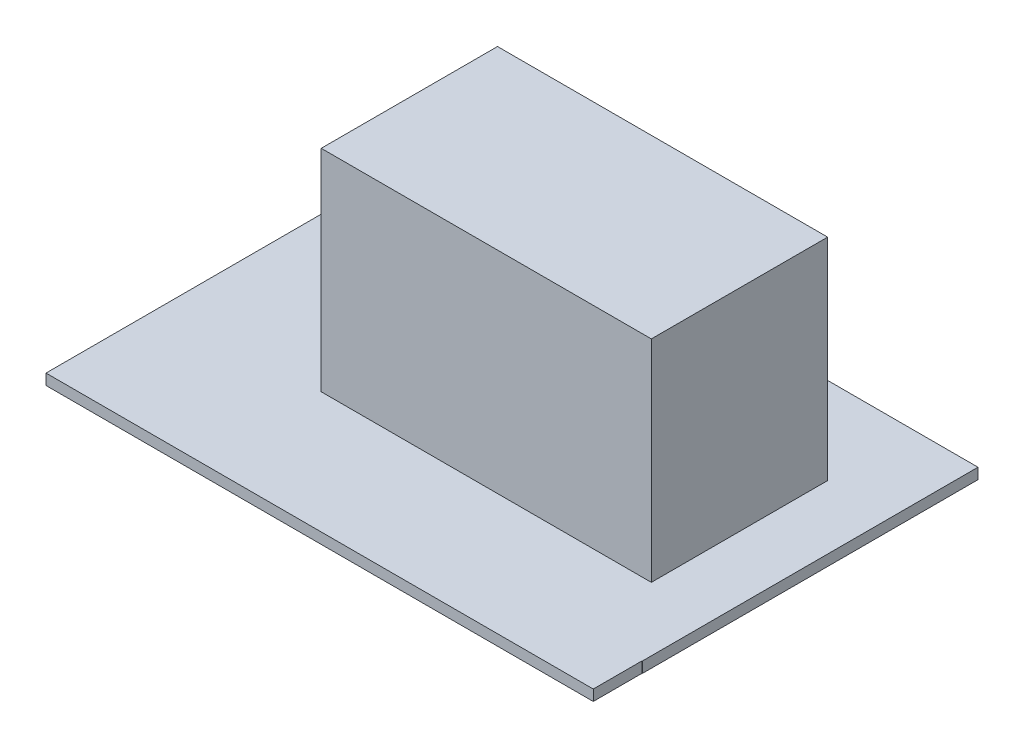
ISO-10303-21;
HEADER;
FILE_DESCRIPTION(('STEP AP214'),'2;1');
FILE_NAME('part.step','',(''),(''),'','','');
FILE_SCHEMA(('AUTOMOTIVE_DESIGN { 1 0 10303 214 1 1 1 1 }'));
ENDSEC;
DATA;
#1=APPLICATION_CONTEXT('core data for automotive mechanical design processes');
#2=APPLICATION_PROTOCOL_DEFINITION('international standard','automotive_design',2000,#1);
#3=PRODUCT_CONTEXT('',#1,'mechanical');
#4=PRODUCT('Part','Part','',(#3));
#5=PRODUCT_RELATED_PRODUCT_CATEGORY('part','',(#4));
#6=PRODUCT_DEFINITION_FORMATION('','',#4);
#7=PRODUCT_DEFINITION_CONTEXT('part definition',#1,'design');
#8=PRODUCT_DEFINITION('design','',#6,#7);
#9=PRODUCT_DEFINITION_SHAPE('','',#8);
#10=(LENGTH_UNIT() NAMED_UNIT(*) SI_UNIT(.MILLI.,.METRE.));
#11=(NAMED_UNIT(*) PLANE_ANGLE_UNIT() SI_UNIT($,.RADIAN.));
#12=(NAMED_UNIT(*) SI_UNIT($,.STERADIAN.) SOLID_ANGLE_UNIT());
#13=UNCERTAINTY_MEASURE_WITH_UNIT(LENGTH_MEASURE(1.E-05),#10,'distance_accuracy_value','');
#14=(GEOMETRIC_REPRESENTATION_CONTEXT(3) GLOBAL_UNCERTAINTY_ASSIGNED_CONTEXT((#13)) GLOBAL_UNIT_ASSIGNED_CONTEXT((#10,
#11,#12)) REPRESENTATION_CONTEXT('',''));
#15=CARTESIAN_POINT('',(0.,0.,0.));
#16=DIRECTION('',(0.,0.,1.));
#17=DIRECTION('',(1.,0.,0.));
#18=AXIS2_PLACEMENT_3D('',#15,#16,#17);
#19=CARTESIAN_POINT('',(0.,1.5875,0.));
#20=DIRECTION('',(0.,1.,0.));
#21=DIRECTION('',(0.,0.,1.));
#22=AXIS2_PLACEMENT_3D('',#19,#20,#21);
#23=PLANE('',#22);
#24=DIRECTION('',(-1.,0.,0.));
#25=VECTOR('',#24,1.);
#26=CARTESIAN_POINT('',(80.4672,1.5875,0.));
#27=LINE('',#26,#25);
#28=CARTESIAN_POINT('',(80.4672,1.5875,0.));
#29=VERTEX_POINT('',#28);
#30=CARTESIAN_POINT('',(0.,1.5875,0.));
#31=VERTEX_POINT('',#30);
#32=EDGE_CURVE('E192',#29,#31,#27,.T.);
#33=ORIENTED_EDGE('',*,*,#32,.T.);
#34=DIRECTION('',(0.,0.,1.));
#35=VECTOR('',#34,1.);
#36=CARTESIAN_POINT('',(0.,1.5875,0.));
#37=LINE('',#36,#35);
#38=CARTESIAN_POINT('',(0.,1.5875,56.4985128166023));
#39=VERTEX_POINT('',#38);
#40=EDGE_CURVE('E185',#31,#39,#37,.T.);
#41=ORIENTED_EDGE('',*,*,#40,.T.);
#42=DIRECTION('',(1.,0.,0.));
#43=VECTOR('',#42,1.);
#44=CARTESIAN_POINT('',(0.,1.5875,56.4985128166023));
#45=LINE('',#44,#43);
#46=CARTESIAN_POINT('',(80.4243209555985,1.5875,56.4985128166023));
#47=VERTEX_POINT('',#46);
#48=EDGE_CURVE('E190',#39,#47,#45,.T.);
#49=ORIENTED_EDGE('',*,*,#48,.T.);
#50=DIRECTION('',(0.,0.,-1.));
#51=VECTOR('',#50,1.);
#52=CARTESIAN_POINT('',(80.4243209555985,1.5875,0.));
#53=LINE('',#52,#51);
#54=CARTESIAN_POINT('',(80.4243209555985,1.5875,49.3268));
#55=VERTEX_POINT('',#54);
#56=EDGE_CURVE('E205',#47,#55,#53,.T.);
#57=ORIENTED_EDGE('',*,*,#56,.T.);
#58=DIRECTION('',(1.,0.,0.));
#59=VECTOR('',#58,1.);
#60=CARTESIAN_POINT('',(31.9532,1.5875,49.3268));
#61=LINE('',#60,#59);
#62=CARTESIAN_POINT('',(80.4672,1.5875,49.3268));
#63=VERTEX_POINT('',#62);
#64=EDGE_CURVE('E49',#55,#63,#61,.T.);
#65=ORIENTED_EDGE('',*,*,#64,.T.);
#66=DIRECTION('',(0.,0.,-1.));
#67=VECTOR('',#66,1.);
#68=CARTESIAN_POINT('',(80.4672,1.5875,49.3268));
#69=LINE('',#68,#67);
#70=EDGE_CURVE('E405',#63,#29,#69,.T.);
#71=ORIENTED_EDGE('',*,*,#70,.T.);
#72=EDGE_LOOP('',(#33,#41,#49,#57,#65,#71));
#73=FACE_BOUND('',#72,.T.);
#74=DIRECTION('',(-1.,0.,0.));
#75=VECTOR('',#74,1.);
#76=CARTESIAN_POINT('',(71.12,1.5875,12.7508));
#77=LINE('',#76,#75);
#78=CARTESIAN_POINT('',(71.12,1.5875,12.7508));
#79=VERTEX_POINT('',#78);
#80=CARTESIAN_POINT('',(22.606,1.5875,12.7508));
#81=VERTEX_POINT('',#80);
#82=EDGE_CURVE('E232',#79,#81,#77,.T.);
#83=ORIENTED_EDGE('',*,*,#82,.F.);
#84=DIRECTION('',(0.,0.,-1.));
#85=VECTOR('',#84,1.);
#86=CARTESIAN_POINT('',(71.12,1.5875,12.7508));
#87=LINE('',#86,#85);
#88=CARTESIAN_POINT('',(71.12,1.5875,38.6588));
#89=VERTEX_POINT('',#88);
#90=EDGE_CURVE('E218',#89,#79,#87,.T.);
#91=ORIENTED_EDGE('',*,*,#90,.F.);
#92=DIRECTION('',(1.,0.,0.));
#93=VECTOR('',#92,1.);
#94=CARTESIAN_POINT('',(71.12,1.5875,38.6588));
#95=LINE('',#94,#93);
#96=CARTESIAN_POINT('',(22.606,1.5875,38.6588));
#97=VERTEX_POINT('',#96);
#98=EDGE_CURVE('E223',#97,#89,#95,.T.);
#99=ORIENTED_EDGE('',*,*,#98,.F.);
#100=DIRECTION('',(0.,0.,1.));
#101=VECTOR('',#100,1.);
#102=CARTESIAN_POINT('',(22.606,1.5875,12.7508));
#103=LINE('',#102,#101);
#104=EDGE_CURVE('E234',#81,#97,#103,.T.);
#105=ORIENTED_EDGE('',*,*,#104,.F.);
#106=EDGE_LOOP('',(#83,#91,#99,#105));
#107=FACE_BOUND('',#106,.T.);
#108=ADVANCED_FACE('F35',(#73,#107),#23,.T.);
#109=CARTESIAN_POINT('',(36.068,-21.2725,1.5875));
#110=DIRECTION('',(0.,0.,-1.));
#111=DIRECTION('',(-1.,0.,0.));
#112=AXIS2_PLACEMENT_3D('',#109,#110,#111);
#113=PLANE('',#112);
#114=CARTESIAN_POINT('',(18.034,-9.8425,1.5875));
#115=DIRECTION('',(0.,0.,-1.));
#116=DIRECTION('',(-1.,0.,0.));
#117=AXIS2_PLACEMENT_3D('',#114,#115,#116);
#118=CIRCLE('',#117,2.54000000000001);
#119=CARTESIAN_POINT('',(15.494,-9.8425,1.5875));
#120=VERTEX_POINT('',#119);
#121=EDGE_CURVE('E248',#120,#120,#118,.T.);
#122=ORIENTED_EDGE('',*,*,#121,.T.);
#123=EDGE_LOOP('',(#122));
#124=FACE_BOUND('',#123,.T.);
#125=DIRECTION('',(-1.,0.,0.));
#126=VECTOR('',#125,1.);
#127=CARTESIAN_POINT('',(0.,-9.144,1.5875));
#128=LINE('',#127,#126);
#129=CARTESIAN_POINT('',(1.58749999999999,-9.144,1.5875));
#130=VERTEX_POINT('',#129);
#131=CARTESIAN_POINT('',(0.,-9.144,1.5875));
#132=VERTEX_POINT('',#131);
#133=EDGE_CURVE('E251',#130,#132,#128,.T.);
#134=ORIENTED_EDGE('',*,*,#133,.F.);
#135=DIRECTION('',(0.,1.,0.));
#136=VECTOR('',#135,1.);
#137=CARTESIAN_POINT('',(1.58749999999999,-9.144,1.5875));
#138=LINE('',#137,#136);
#139=CARTESIAN_POINT('',(1.58749999999999,-21.2725,1.5875));
#140=VERTEX_POINT('',#139);
#141=EDGE_CURVE('E269',#140,#130,#138,.T.);
#142=ORIENTED_EDGE('',*,*,#141,.F.);
#143=DIRECTION('',(-1.,0.,0.));
#144=VECTOR('',#143,1.);
#145=CARTESIAN_POINT('',(36.068,-21.2725,1.5875));
#146=LINE('',#145,#144);
#147=CARTESIAN_POINT('',(34.4805,-21.2725,1.5875));
#148=VERTEX_POINT('',#147);
#149=EDGE_CURVE('E322',#148,#140,#146,.T.);
#150=ORIENTED_EDGE('',*,*,#149,.F.);
#151=DIRECTION('',(0.,-1.,0.));
#152=VECTOR('',#151,1.);
#153=CARTESIAN_POINT('',(34.4805,-9.144,1.5875));
#154=LINE('',#153,#152);
#155=CARTESIAN_POINT('',(34.4805,-9.144,1.5875));
#156=VERTEX_POINT('',#155);
#157=EDGE_CURVE('E299',#156,#148,#154,.T.);
#158=ORIENTED_EDGE('',*,*,#157,.F.);
#159=DIRECTION('',(-1.,0.,0.));
#160=VECTOR('',#159,1.);
#161=CARTESIAN_POINT('',(36.068,-9.144,1.5875));
#162=LINE('',#161,#160);
#163=CARTESIAN_POINT('',(36.068,-9.144,1.5875));
#164=VERTEX_POINT('',#163);
#165=EDGE_CURVE('E296',#164,#156,#162,.T.);
#166=ORIENTED_EDGE('',*,*,#165,.F.);
#167=DIRECTION('',(0.,1.,0.));
#168=VECTOR('',#167,1.);
#169=CARTESIAN_POINT('',(36.068,-21.2725,1.5875));
#170=LINE('',#169,#168);
#171=CARTESIAN_POINT('',(36.068,0.,1.5875));
#172=VERTEX_POINT('',#171);
#173=EDGE_CURVE('E330',#164,#172,#170,.T.);
#174=ORIENTED_EDGE('',*,*,#173,.T.);
#175=DIRECTION('',(-1.,0.,0.));
#176=VECTOR('',#175,1.);
#177=CARTESIAN_POINT('',(36.068,0.,1.5875));
#178=LINE('',#177,#176);
#179=CARTESIAN_POINT('',(0.,0.,1.5875));
#180=VERTEX_POINT('',#179);
#181=EDGE_CURVE('E317',#172,#180,#178,.T.);
#182=ORIENTED_EDGE('',*,*,#181,.T.);
#183=DIRECTION('',(0.,1.,0.));
#184=VECTOR('',#183,1.);
#185=CARTESIAN_POINT('',(0.,-21.2725,1.5875));
#186=LINE('',#185,#184);
#187=EDGE_CURVE('E341',#132,#180,#186,.T.);
#188=ORIENTED_EDGE('',*,*,#187,.F.);
#189=EDGE_LOOP('',(#134,#142,#150,#158,#166,#174,#182,#188));
#190=FACE_BOUND('',#189,.T.);
#191=ADVANCED_FACE('F369',(#124,#190),#113,.F.);
#192=CARTESIAN_POINT('',(0.,0.,0.));
#193=DIRECTION('',(0.,1.,0.));
#194=DIRECTION('',(0.,0.,1.));
#195=AXIS2_PLACEMENT_3D('',#192,#193,#194);
#196=PLANE('',#195);
#197=DIRECTION('',(1.,0.,0.));
#198=VECTOR('',#197,1.);
#199=CARTESIAN_POINT('',(31.9532,0.,49.3268));
#200=LINE('',#199,#198);
#201=CARTESIAN_POINT('',(80.4243209555985,0.,49.3268));
#202=VERTEX_POINT('',#201);
#203=CARTESIAN_POINT('',(80.4672,0.,49.3268));
#204=VERTEX_POINT('',#203);
#205=EDGE_CURVE('E409',#202,#204,#200,.T.);
#206=ORIENTED_EDGE('',*,*,#205,.F.);
#207=DIRECTION('',(0.,0.,1.));
#208=VECTOR('',#207,1.);
#209=CARTESIAN_POINT('',(80.4243209555985,0.,0.));
#210=LINE('',#209,#208);
#211=CARTESIAN_POINT('',(80.4243209555985,0.,56.4985128166023));
#212=VERTEX_POINT('',#211);
#213=EDGE_CURVE('E213',#202,#212,#210,.T.);
#214=ORIENTED_EDGE('',*,*,#213,.T.);
#215=DIRECTION('',(-1.,0.,0.));
#216=VECTOR('',#215,1.);
#217=CARTESIAN_POINT('',(0.,0.,56.4985128166023));
#218=LINE('',#217,#216);
#219=CARTESIAN_POINT('',(0.,0.,56.4985128166023));
#220=VERTEX_POINT('',#219);
#221=EDGE_CURVE('E216',#212,#220,#218,.T.);
#222=ORIENTED_EDGE('',*,*,#221,.T.);
#223=DIRECTION('',(0.,0.,1.));
#224=VECTOR('',#223,1.);
#225=CARTESIAN_POINT('',(0.,0.,0.));
#226=LINE('',#225,#224);
#227=EDGE_CURVE('E200',#180,#220,#226,.T.);
#228=ORIENTED_EDGE('',*,*,#227,.F.);
#229=ORIENTED_EDGE('',*,*,#181,.F.);
#230=DIRECTION('',(0.,0.,1.));
#231=VECTOR('',#230,1.);
#232=CARTESIAN_POINT('',(36.068,0.,0.));
#233=LINE('',#232,#231);
#234=CARTESIAN_POINT('',(36.068,0.,0.));
#235=VERTEX_POINT('',#234);
#236=EDGE_CURVE('E312',#235,#172,#233,.T.);
#237=ORIENTED_EDGE('',*,*,#236,.F.);
#238=DIRECTION('',(-1.,0.,0.));
#239=VECTOR('',#238,1.);
#240=CARTESIAN_POINT('',(80.4672,0.,0.));
#241=LINE('',#240,#239);
#242=CARTESIAN_POINT('',(80.4672,0.,0.));
#243=VERTEX_POINT('',#242);
#244=EDGE_CURVE('E359',#243,#235,#241,.T.);
#245=ORIENTED_EDGE('',*,*,#244,.F.);
#246=DIRECTION('',(0.,0.,-1.));
#247=VECTOR('',#246,1.);
#248=CARTESIAN_POINT('',(80.4672,0.,49.3268));
#249=LINE('',#248,#247);
#250=EDGE_CURVE('E411',#204,#243,#249,.T.);
#251=ORIENTED_EDGE('',*,*,#250,.F.);
#252=EDGE_LOOP('',(#206,#214,#222,#228,#229,#237,#245,#251));
#253=FACE_BOUND('',#252,.T.);
#254=ADVANCED_FACE('F365',(#253),#196,.F.);
#255=CARTESIAN_POINT('',(80.4672,1.5875,0.));
#256=DIRECTION('',(0.,0.,1.));
#257=DIRECTION('',(1.,0.,0.));
#258=AXIS2_PLACEMENT_3D('',#255,#256,#257);
#259=PLANE('',#258);
#260=ORIENTED_EDGE('',*,*,#244,.T.);
#261=DIRECTION('',(0.,1.,0.));
#262=VECTOR('',#261,1.);
#263=CARTESIAN_POINT('',(36.068,-21.2725,0.));
#264=LINE('',#263,#262);
#265=CARTESIAN_POINT('',(36.068,-21.2725,0.));
#266=VERTEX_POINT('',#265);
#267=EDGE_CURVE('E327',#266,#235,#264,.T.);
#268=ORIENTED_EDGE('',*,*,#267,.F.);
#269=DIRECTION('',(1.,0.,0.));
#270=VECTOR('',#269,1.);
#271=CARTESIAN_POINT('',(36.068,-21.2725,0.));
#272=LINE('',#271,#270);
#273=CARTESIAN_POINT('',(0.,-21.2725,0.));
#274=VERTEX_POINT('',#273);
#275=EDGE_CURVE('E325',#274,#266,#272,.T.);
#276=ORIENTED_EDGE('',*,*,#275,.F.);
#277=DIRECTION('',(0.,-1.,0.));
#278=VECTOR('',#277,1.);
#279=CARTESIAN_POINT('',(0.,1.5875,0.));
#280=LINE('',#279,#278);
#281=EDGE_CURVE('E43',#31,#274,#280,.T.);
#282=ORIENTED_EDGE('',*,*,#281,.F.);
#283=ORIENTED_EDGE('',*,*,#32,.F.);
#284=DIRECTION('',(0.,-1.,0.));
#285=VECTOR('',#284,1.);
#286=CARTESIAN_POINT('',(80.4672,1.5875,0.));
#287=LINE('',#286,#285);
#288=EDGE_CURVE('E361',#29,#243,#287,.T.);
#289=ORIENTED_EDGE('',*,*,#288,.T.);
#290=EDGE_LOOP('',(#260,#268,#276,#282,#283,#289));
#291=FACE_BOUND('',#290,.T.);
#292=CARTESIAN_POINT('',(18.034,-9.8425,0.));
#293=DIRECTION('',(0.,0.,-1.));
#294=DIRECTION('',(-1.,0.,0.));
#295=AXIS2_PLACEMENT_3D('',#292,#293,#294);
#296=CIRCLE('',#295,2.54000000000001);
#297=CARTESIAN_POINT('',(15.494,-9.8425,0.));
#298=VERTEX_POINT('',#297);
#299=EDGE_CURVE('E245',#298,#298,#296,.T.);
#300=ORIENTED_EDGE('',*,*,#299,.F.);
#301=EDGE_LOOP('',(#300));
#302=FACE_BOUND('',#301,.T.);
#303=ADVANCED_FACE('F37',(#291,#302),#259,.F.);
#304=CARTESIAN_POINT('',(0.,1.5875,0.));
#305=DIRECTION('',(1.,0.,0.));
#306=DIRECTION('',(0.,0.,-1.));
#307=AXIS2_PLACEMENT_3D('',#304,#305,#306);
#308=PLANE('',#307);
#309=ORIENTED_EDGE('',*,*,#281,.T.);
#310=DIRECTION('',(0.,0.,-1.));
#311=VECTOR('',#310,1.);
#312=CARTESIAN_POINT('',(0.,-21.2725,0.));
#313=LINE('',#312,#311);
#314=CARTESIAN_POINT('',(0.,-21.2725,1.5875));
#315=VERTEX_POINT('',#314);
#316=EDGE_CURVE('E321',#315,#274,#313,.T.);
#317=ORIENTED_EDGE('',*,*,#316,.F.);
#318=DIRECTION('',(0.,-1.,0.));
#319=VECTOR('',#318,1.);
#320=CARTESIAN_POINT('',(0.,-9.144,1.5875));
#321=LINE('',#320,#319);
#322=CARTESIAN_POINT('',(0.,-34.798,1.5875));
#323=VERTEX_POINT('',#322);
#324=EDGE_CURVE('E265',#315,#323,#321,.T.);
#325=ORIENTED_EDGE('',*,*,#324,.T.);
#326=DIRECTION('',(0.,0.,-1.));
#327=VECTOR('',#326,1.);
#328=CARTESIAN_POINT('',(0.,-34.798,7.93749999999999));
#329=LINE('',#328,#327);
#330=CARTESIAN_POINT('',(0.,-34.798,7.93749999999999));
#331=VERTEX_POINT('',#330);
#332=EDGE_CURVE('E277',#331,#323,#329,.T.);
#333=ORIENTED_EDGE('',*,*,#332,.F.);
#334=DIRECTION('',(0.,-1.,0.));
#335=VECTOR('',#334,1.);
#336=CARTESIAN_POINT('',(0.,-9.144,7.93749999999999));
#337=LINE('',#336,#335);
#338=CARTESIAN_POINT('',(0.,-9.144,7.93749999999999));
#339=VERTEX_POINT('',#338);
#340=EDGE_CURVE('E255',#339,#331,#337,.T.);
#341=ORIENTED_EDGE('',*,*,#340,.F.);
#342=DIRECTION('',(0.,0.,-1.));
#343=VECTOR('',#342,1.);
#344=CARTESIAN_POINT('',(0.,-9.144,7.93749999999999));
#345=LINE('',#344,#343);
#346=EDGE_CURVE('E280',#339,#132,#345,.T.);
#347=ORIENTED_EDGE('',*,*,#346,.T.);
#348=ORIENTED_EDGE('',*,*,#187,.T.);
#349=ORIENTED_EDGE('',*,*,#227,.T.);
#350=DIRECTION('',(0.,1.,0.));
#351=VECTOR('',#350,1.);
#352=CARTESIAN_POINT('',(0.,-98.2860791346205,56.4985128166023));
#353=LINE('',#352,#351);
#354=EDGE_CURVE('E197',#220,#39,#353,.T.);
#355=ORIENTED_EDGE('',*,*,#354,.T.);
#356=ORIENTED_EDGE('',*,*,#40,.F.);
#357=EDGE_LOOP('',(#309,#317,#325,#333,#341,#347,#348,#349,#355,#356));
#358=FACE_BOUND('',#357,.T.);
#359=ADVANCED_FACE('F198',(#358),#308,.F.);
#360=CARTESIAN_POINT('',(31.9532,1.5875,49.3268));
#361=DIRECTION('',(0.,0.,-1.));
#362=DIRECTION('',(-1.,0.,0.));
#363=AXIS2_PLACEMENT_3D('',#360,#361,#362);
#364=PLANE('',#363);
#365=ORIENTED_EDGE('',*,*,#64,.F.);
#366=DIRECTION('',(0.,-1.,0.));
#367=VECTOR('',#366,1.);
#368=CARTESIAN_POINT('',(80.4243209555985,1.5875,49.3268));
#369=LINE('',#368,#367);
#370=EDGE_CURVE('E11',#55,#202,#369,.T.);
#371=ORIENTED_EDGE('',*,*,#370,.T.);
#372=ORIENTED_EDGE('',*,*,#205,.T.);
#373=DIRECTION('',(0.,-1.,0.));
#374=VECTOR('',#373,1.);
#375=CARTESIAN_POINT('',(80.4672,1.5875,49.3268));
#376=LINE('',#375,#374);
#377=EDGE_CURVE('E397',#63,#204,#376,.T.);
#378=ORIENTED_EDGE('',*,*,#377,.F.);
#379=EDGE_LOOP('',(#365,#371,#372,#378));
#380=FACE_BOUND('',#379,.T.);
#381=ADVANCED_FACE('F413',(#380),#364,.F.);
#382=CARTESIAN_POINT('',(80.4672,1.5875,49.3268));
#383=DIRECTION('',(-1.,0.,0.));
#384=DIRECTION('',(0.,0.,1.));
#385=AXIS2_PLACEMENT_3D('',#382,#383,#384);
#386=PLANE('',#385);
#387=ORIENTED_EDGE('',*,*,#250,.T.);
#388=ORIENTED_EDGE('',*,*,#288,.F.);
#389=ORIENTED_EDGE('',*,*,#70,.F.);
#390=ORIENTED_EDGE('',*,*,#377,.T.);
#391=EDGE_LOOP('',(#387,#388,#389,#390));
#392=FACE_BOUND('',#391,.T.);
#393=ADVANCED_FACE('F415',(#392),#386,.F.);
#394=CARTESIAN_POINT('',(36.068,-21.2725,0.));
#395=DIRECTION('',(-1.,0.,0.));
#396=DIRECTION('',(0.,0.,1.));
#397=AXIS2_PLACEMENT_3D('',#394,#395,#396);
#398=PLANE('',#397);
#399=ORIENTED_EDGE('',*,*,#236,.T.);
#400=ORIENTED_EDGE('',*,*,#173,.F.);
#401=DIRECTION('',(0.,0.,-1.));
#402=VECTOR('',#401,1.);
#403=CARTESIAN_POINT('',(36.068,-9.144,7.93749999999999));
#404=LINE('',#403,#402);
#405=CARTESIAN_POINT('',(36.068,-9.144,7.93749999999999));
#406=VERTEX_POINT('',#405);
#407=EDGE_CURVE('E310',#406,#164,#404,.T.);
#408=ORIENTED_EDGE('',*,*,#407,.F.);
#409=DIRECTION('',(0.,1.,0.));
#410=VECTOR('',#409,1.);
#411=CARTESIAN_POINT('',(36.068,-9.144,7.93749999999999));
#412=LINE('',#411,#410);
#413=CARTESIAN_POINT('',(36.068,-34.798,7.93749999999999));
#414=VERTEX_POINT('',#413);
#415=EDGE_CURVE('E283',#414,#406,#412,.T.);
#416=ORIENTED_EDGE('',*,*,#415,.F.);
#417=DIRECTION('',(0.,0.,-1.));
#418=VECTOR('',#417,1.);
#419=CARTESIAN_POINT('',(36.068,-34.798,7.93749999999999));
#420=LINE('',#419,#418);
#421=CARTESIAN_POINT('',(36.068,-34.798,1.5875));
#422=VERTEX_POINT('',#421);
#423=EDGE_CURVE('E293',#414,#422,#420,.T.);
#424=ORIENTED_EDGE('',*,*,#423,.T.);
#425=DIRECTION('',(0.,1.,0.));
#426=VECTOR('',#425,1.);
#427=CARTESIAN_POINT('',(36.068,-9.144,1.5875));
#428=LINE('',#427,#426);
#429=CARTESIAN_POINT('',(36.068,-21.2725,1.5875));
#430=VERTEX_POINT('',#429);
#431=EDGE_CURVE('E282',#422,#430,#428,.T.);
#432=ORIENTED_EDGE('',*,*,#431,.T.);
#433=DIRECTION('',(0.,0.,1.));
#434=VECTOR('',#433,1.);
#435=CARTESIAN_POINT('',(36.068,-21.2725,0.));
#436=LINE('',#435,#434);
#437=EDGE_CURVE('E313',#266,#430,#436,.T.);
#438=ORIENTED_EDGE('',*,*,#437,.F.);
#439=ORIENTED_EDGE('',*,*,#267,.T.);
#440=EDGE_LOOP('',(#399,#400,#408,#416,#424,#432,#438,#439));
#441=FACE_BOUND('',#440,.T.);
#442=ADVANCED_FACE('F351',(#441),#398,.F.);
#443=CARTESIAN_POINT('',(36.068,-21.2725,1.5875));
#444=DIRECTION('',(0.,-1.,0.));
#445=DIRECTION('',(0.,0.,-1.));
#446=AXIS2_PLACEMENT_3D('',#443,#444,#445);
#447=PLANE('',#446);
#448=ORIENTED_EDGE('',*,*,#437,.T.);
#449=EDGE_CURVE('E318',#430,#148,#146,.T.);
#450=ORIENTED_EDGE('',*,*,#449,.T.);
#451=ORIENTED_EDGE('',*,*,#149,.T.);
#452=EDGE_CURVE('E316',#140,#315,#146,.T.);
#453=ORIENTED_EDGE('',*,*,#452,.T.);
#454=ORIENTED_EDGE('',*,*,#316,.T.);
#455=ORIENTED_EDGE('',*,*,#275,.T.);
#456=EDGE_LOOP('',(#448,#450,#451,#453,#454,#455));
#457=FACE_BOUND('',#456,.T.);
#458=ADVANCED_FACE('F393',(#457),#447,.T.);
#459=CARTESIAN_POINT('',(36.068,-9.144,7.93749999999999));
#460=DIRECTION('',(0.,-1.,0.));
#461=DIRECTION('',(0.,0.,-1.));
#462=AXIS2_PLACEMENT_3D('',#459,#460,#461);
#463=PLANE('',#462);
#464=ORIENTED_EDGE('',*,*,#165,.T.);
#465=DIRECTION('',(0.,0.,-1.));
#466=VECTOR('',#465,1.);
#467=CARTESIAN_POINT('',(34.4805,-9.144,7.93749999999999));
#468=LINE('',#467,#466);
#469=CARTESIAN_POINT('',(34.4805,-9.144,7.93749999999999));
#470=VERTEX_POINT('',#469);
#471=EDGE_CURVE('E307',#470,#156,#468,.T.);
#472=ORIENTED_EDGE('',*,*,#471,.F.);
#473=DIRECTION('',(-1.,0.,0.));
#474=VECTOR('',#473,1.);
#475=CARTESIAN_POINT('',(36.068,-9.144,7.93749999999999));
#476=LINE('',#475,#474);
#477=EDGE_CURVE('E286',#406,#470,#476,.T.);
#478=ORIENTED_EDGE('',*,*,#477,.F.);
#479=ORIENTED_EDGE('',*,*,#407,.T.);
#480=EDGE_LOOP('',(#464,#472,#478,#479));
#481=FACE_BOUND('',#480,.T.);
#482=ADVANCED_FACE('F375',(#481),#463,.F.);
#483=CARTESIAN_POINT('',(34.4805,-9.144,7.93749999999999));
#484=DIRECTION('',(1.,0.,0.));
#485=DIRECTION('',(0.,1.,0.));
#486=AXIS2_PLACEMENT_3D('',#483,#484,#485);
#487=PLANE('',#486);
#488=ORIENTED_EDGE('',*,*,#157,.T.);
#489=CARTESIAN_POINT('',(34.4805,-34.798,1.5875));
#490=VERTEX_POINT('',#489);
#491=EDGE_CURVE('E298',#148,#490,#154,.T.);
#492=ORIENTED_EDGE('',*,*,#491,.T.);
#493=DIRECTION('',(0.,0.,-1.));
#494=VECTOR('',#493,1.);
#495=CARTESIAN_POINT('',(34.4805,-34.798,7.93749999999999));
#496=LINE('',#495,#494);
#497=CARTESIAN_POINT('',(34.4805,-34.798,7.93749999999999));
#498=VERTEX_POINT('',#497);
#499=EDGE_CURVE('E304',#498,#490,#496,.T.);
#500=ORIENTED_EDGE('',*,*,#499,.F.);
#501=DIRECTION('',(0.,-1.,0.));
#502=VECTOR('',#501,1.);
#503=CARTESIAN_POINT('',(34.4805,-9.144,7.93749999999999));
#504=LINE('',#503,#502);
#505=EDGE_CURVE('E289',#470,#498,#504,.T.);
#506=ORIENTED_EDGE('',*,*,#505,.F.);
#507=ORIENTED_EDGE('',*,*,#471,.T.);
#508=EDGE_LOOP('',(#488,#492,#500,#506,#507));
#509=FACE_BOUND('',#508,.T.);
#510=ADVANCED_FACE('F578',(#509),#487,.F.);
#511=CARTESIAN_POINT('',(36.068,-34.798,7.93749999999999));
#512=DIRECTION('',(0.,1.,0.));
#513=DIRECTION('',(0.,0.,1.));
#514=AXIS2_PLACEMENT_3D('',#511,#512,#513);
#515=PLANE('',#514);
#516=DIRECTION('',(1.,0.,0.));
#517=VECTOR('',#516,1.);
#518=CARTESIAN_POINT('',(36.068,-34.798,1.5875));
#519=LINE('',#518,#517);
#520=EDGE_CURVE('E287',#490,#422,#519,.T.);
#521=ORIENTED_EDGE('',*,*,#520,.T.);
#522=ORIENTED_EDGE('',*,*,#423,.F.);
#523=DIRECTION('',(1.,0.,0.));
#524=VECTOR('',#523,1.);
#525=CARTESIAN_POINT('',(36.068,-34.798,7.93749999999999));
#526=LINE('',#525,#524);
#527=EDGE_CURVE('E291',#498,#414,#526,.T.);
#528=ORIENTED_EDGE('',*,*,#527,.F.);
#529=ORIENTED_EDGE('',*,*,#499,.T.);
#530=EDGE_LOOP('',(#521,#522,#528,#529));
#531=FACE_BOUND('',#530,.T.);
#532=ADVANCED_FACE('F384',(#531),#515,.F.);
#533=CARTESIAN_POINT('',(36.068,-34.798,7.93749999999999));
#534=DIRECTION('',(0.,0.,-1.));
#535=DIRECTION('',(-1.,0.,0.));
#536=AXIS2_PLACEMENT_3D('',#533,#534,#535);
#537=PLANE('',#536);
#538=ORIENTED_EDGE('',*,*,#415,.T.);
#539=ORIENTED_EDGE('',*,*,#477,.T.);
#540=ORIENTED_EDGE('',*,*,#505,.T.);
#541=ORIENTED_EDGE('',*,*,#527,.T.);
#542=EDGE_LOOP('',(#538,#539,#540,#541));
#543=FACE_BOUND('',#542,.T.);
#544=ADVANCED_FACE('F379',(#543),#537,.F.);
#545=CARTESIAN_POINT('',(36.068,-34.798,1.5875));
#546=DIRECTION('',(0.,0.,-1.));
#547=DIRECTION('',(-1.,0.,0.));
#548=AXIS2_PLACEMENT_3D('',#545,#546,#547);
#549=PLANE('',#548);
#550=ORIENTED_EDGE('',*,*,#491,.F.);
#551=ORIENTED_EDGE('',*,*,#449,.F.);
#552=ORIENTED_EDGE('',*,*,#431,.F.);
#553=ORIENTED_EDGE('',*,*,#520,.F.);
#554=EDGE_LOOP('',(#550,#551,#552,#553));
#555=FACE_BOUND('',#554,.T.);
#556=ADVANCED_FACE('F389',(#555),#549,.T.);
#557=CARTESIAN_POINT('',(0.,-9.144,7.93749999999999));
#558=DIRECTION('',(0.,-1.,0.));
#559=DIRECTION('',(1.,0.,0.));
#560=AXIS2_PLACEMENT_3D('',#557,#558,#559);
#561=PLANE('',#560);
#562=ORIENTED_EDGE('',*,*,#133,.T.);
#563=ORIENTED_EDGE('',*,*,#346,.F.);
#564=DIRECTION('',(-1.,0.,0.));
#565=VECTOR('',#564,1.);
#566=CARTESIAN_POINT('',(0.,-9.144,7.93749999999999));
#567=LINE('',#566,#565);
#568=CARTESIAN_POINT('',(1.58749999999999,-9.144,7.93749999999999));
#569=VERTEX_POINT('',#568);
#570=EDGE_CURVE('E252',#569,#339,#567,.T.);
#571=ORIENTED_EDGE('',*,*,#570,.F.);
#572=DIRECTION('',(0.,0.,-1.));
#573=VECTOR('',#572,1.);
#574=CARTESIAN_POINT('',(1.58749999999999,-9.144,7.93749999999999));
#575=LINE('',#574,#573);
#576=EDGE_CURVE('E262',#569,#130,#575,.T.);
#577=ORIENTED_EDGE('',*,*,#576,.T.);
#578=EDGE_LOOP('',(#562,#563,#571,#577));
#579=FACE_BOUND('',#578,.T.);
#580=ADVANCED_FACE('F604',(#579),#561,.F.);
#581=CARTESIAN_POINT('',(0.,-34.798,7.93749999999999));
#582=DIRECTION('',(0.,1.,0.));
#583=DIRECTION('',(0.,0.,1.));
#584=AXIS2_PLACEMENT_3D('',#581,#582,#583);
#585=PLANE('',#584);
#586=DIRECTION('',(1.,0.,0.));
#587=VECTOR('',#586,1.);
#588=CARTESIAN_POINT('',(0.,-34.798,1.5875));
#589=LINE('',#588,#587);
#590=CARTESIAN_POINT('',(1.5875,-34.798,1.5875));
#591=VERTEX_POINT('',#590);
#592=EDGE_CURVE('E267',#323,#591,#589,.T.);
#593=ORIENTED_EDGE('',*,*,#592,.T.);
#594=DIRECTION('',(0.,0.,-1.));
#595=VECTOR('',#594,1.);
#596=CARTESIAN_POINT('',(1.5875,-34.798,7.93749999999999));
#597=LINE('',#596,#595);
#598=CARTESIAN_POINT('',(1.5875,-34.798,7.93749999999999));
#599=VERTEX_POINT('',#598);
#600=EDGE_CURVE('E274',#599,#591,#597,.T.);
#601=ORIENTED_EDGE('',*,*,#600,.F.);
#602=DIRECTION('',(1.,0.,0.));
#603=VECTOR('',#602,1.);
#604=CARTESIAN_POINT('',(0.,-34.798,7.93749999999999));
#605=LINE('',#604,#603);
#606=EDGE_CURVE('E258',#331,#599,#605,.T.);
#607=ORIENTED_EDGE('',*,*,#606,.F.);
#608=ORIENTED_EDGE('',*,*,#332,.T.);
#609=EDGE_LOOP('',(#593,#601,#607,#608));
#610=FACE_BOUND('',#609,.T.);
#611=ADVANCED_FACE('F611',(#610),#585,.F.);
#612=CARTESIAN_POINT('',(1.58749999999999,-9.144,7.93749999999999));
#613=DIRECTION('',(-1.,0.,0.));
#614=DIRECTION('',(0.,-1.,0.));
#615=AXIS2_PLACEMENT_3D('',#612,#613,#614);
#616=PLANE('',#615);
#617=EDGE_CURVE('E256',#591,#140,#138,.T.);
#618=ORIENTED_EDGE('',*,*,#617,.T.);
#619=ORIENTED_EDGE('',*,*,#141,.T.);
#620=ORIENTED_EDGE('',*,*,#576,.F.);
#621=DIRECTION('',(0.,1.,0.));
#622=VECTOR('',#621,1.);
#623=CARTESIAN_POINT('',(1.58749999999999,-9.144,7.93749999999999));
#624=LINE('',#623,#622);
#625=EDGE_CURVE('E260',#599,#569,#624,.T.);
#626=ORIENTED_EDGE('',*,*,#625,.F.);
#627=ORIENTED_EDGE('',*,*,#600,.T.);
#628=EDGE_LOOP('',(#618,#619,#620,#626,#627));
#629=FACE_BOUND('',#628,.T.);
#630=ADVANCED_FACE('F619',(#629),#616,.F.);
#631=CARTESIAN_POINT('',(1.58749999999999,-9.144,7.93749999999999));
#632=DIRECTION('',(0.,0.,-1.));
#633=DIRECTION('',(-1.,0.,0.));
#634=AXIS2_PLACEMENT_3D('',#631,#632,#633);
#635=PLANE('',#634);
#636=ORIENTED_EDGE('',*,*,#570,.T.);
#637=ORIENTED_EDGE('',*,*,#340,.T.);
#638=ORIENTED_EDGE('',*,*,#606,.T.);
#639=ORIENTED_EDGE('',*,*,#625,.T.);
#640=EDGE_LOOP('',(#636,#637,#638,#639));
#641=FACE_BOUND('',#640,.T.);
#642=ADVANCED_FACE('F627',(#641),#635,.F.);
#643=CARTESIAN_POINT('',(1.58749999999999,-9.144,1.5875));
#644=DIRECTION('',(0.,0.,-1.));
#645=DIRECTION('',(-1.,0.,0.));
#646=AXIS2_PLACEMENT_3D('',#643,#644,#645);
#647=PLANE('',#646);
#648=ORIENTED_EDGE('',*,*,#324,.F.);
#649=ORIENTED_EDGE('',*,*,#452,.F.);
#650=ORIENTED_EDGE('',*,*,#617,.F.);
#651=ORIENTED_EDGE('',*,*,#592,.F.);
#652=EDGE_LOOP('',(#648,#649,#650,#651));
#653=FACE_BOUND('',#652,.T.);
#654=ADVANCED_FACE('F466',(#653),#647,.T.);
#655=CARTESIAN_POINT('',(18.034,-9.8425,0.));
#656=DIRECTION('',(0.,0.,-1.));
#657=DIRECTION('',(-1.,0.,0.));
#658=AXIS2_PLACEMENT_3D('',#655,#656,#657);
#659=CYLINDRICAL_SURFACE('',#658,2.54000000000001);
#660=ORIENTED_EDGE('',*,*,#299,.T.);
#661=EDGE_LOOP('',(#660));
#662=FACE_BOUND('',#661,.T.);
#663=ORIENTED_EDGE('',*,*,#121,.F.);
#664=EDGE_LOOP('',(#663));
#665=FACE_BOUND('',#664,.T.);
#666=ADVANCED_FACE('F471',(#662,#665),#659,.F.);
#667=CARTESIAN_POINT('',(71.12,32.5755,12.7508));
#668=DIRECTION('',(-1.,0.,0.));
#669=DIRECTION('',(0.,0.,1.));
#670=AXIS2_PLACEMENT_3D('',#667,#668,#669);
#671=PLANE('',#670);
#672=ORIENTED_EDGE('',*,*,#90,.T.);
#673=DIRECTION('',(0.,-1.,0.));
#674=VECTOR('',#673,1.);
#675=CARTESIAN_POINT('',(71.12,32.5755,12.7508));
#676=LINE('',#675,#674);
#677=CARTESIAN_POINT('',(71.12,32.5755,12.7508));
#678=VERTEX_POINT('',#677);
#679=EDGE_CURVE('E243',#678,#79,#676,.T.);
#680=ORIENTED_EDGE('',*,*,#679,.F.);
#681=DIRECTION('',(0.,0.,-1.));
#682=VECTOR('',#681,1.);
#683=CARTESIAN_POINT('',(71.12,32.5755,12.7508));
#684=LINE('',#683,#682);
#685=CARTESIAN_POINT('',(71.12,32.5755,38.6588));
#686=VERTEX_POINT('',#685);
#687=EDGE_CURVE('E219',#686,#678,#684,.T.);
#688=ORIENTED_EDGE('',*,*,#687,.F.);
#689=DIRECTION('',(0.,-1.,0.));
#690=VECTOR('',#689,1.);
#691=CARTESIAN_POINT('',(71.12,32.5755,38.6588));
#692=LINE('',#691,#690);
#693=EDGE_CURVE('E229',#686,#89,#692,.T.);
#694=ORIENTED_EDGE('',*,*,#693,.T.);
#695=EDGE_LOOP('',(#672,#680,#688,#694));
#696=FACE_BOUND('',#695,.T.);
#697=ADVANCED_FACE('F476',(#696),#671,.F.);
#698=CARTESIAN_POINT('',(71.12,32.5755,12.7508));
#699=DIRECTION('',(0.,0.,1.));
#700=DIRECTION('',(1.,0.,0.));
#701=AXIS2_PLACEMENT_3D('',#698,#699,#700);
#702=PLANE('',#701);
#703=ORIENTED_EDGE('',*,*,#82,.T.);
#704=DIRECTION('',(0.,-1.,0.));
#705=VECTOR('',#704,1.);
#706=CARTESIAN_POINT('',(22.606,32.5755,12.7508));
#707=LINE('',#706,#705);
#708=CARTESIAN_POINT('',(22.606,32.5755,12.7508));
#709=VERTEX_POINT('',#708);
#710=EDGE_CURVE('E240',#709,#81,#707,.T.);
#711=ORIENTED_EDGE('',*,*,#710,.F.);
#712=DIRECTION('',(-1.,0.,0.));
#713=VECTOR('',#712,1.);
#714=CARTESIAN_POINT('',(71.12,32.5755,12.7508));
#715=LINE('',#714,#713);
#716=EDGE_CURVE('E222',#678,#709,#715,.T.);
#717=ORIENTED_EDGE('',*,*,#716,.F.);
#718=ORIENTED_EDGE('',*,*,#679,.T.);
#719=EDGE_LOOP('',(#703,#711,#717,#718));
#720=FACE_BOUND('',#719,.T.);
#721=ADVANCED_FACE('F487',(#720),#702,.F.);
#722=CARTESIAN_POINT('',(22.606,32.5755,12.7508));
#723=DIRECTION('',(1.,0.,0.));
#724=DIRECTION('',(0.,0.,-1.));
#725=AXIS2_PLACEMENT_3D('',#722,#723,#724);
#726=PLANE('',#725);
#727=ORIENTED_EDGE('',*,*,#104,.T.);
#728=DIRECTION('',(0.,-1.,0.));
#729=VECTOR('',#728,1.);
#730=CARTESIAN_POINT('',(22.606,32.5755,38.6588));
#731=LINE('',#730,#729);
#732=CARTESIAN_POINT('',(22.606,32.5755,38.6588));
#733=VERTEX_POINT('',#732);
#734=EDGE_CURVE('E57',#733,#97,#731,.T.);
#735=ORIENTED_EDGE('',*,*,#734,.F.);
#736=DIRECTION('',(0.,0.,1.));
#737=VECTOR('',#736,1.);
#738=CARTESIAN_POINT('',(22.606,32.5755,12.7508));
#739=LINE('',#738,#737);
#740=EDGE_CURVE('E225',#709,#733,#739,.T.);
#741=ORIENTED_EDGE('',*,*,#740,.F.);
#742=ORIENTED_EDGE('',*,*,#710,.T.);
#743=EDGE_LOOP('',(#727,#735,#741,#742));
#744=FACE_BOUND('',#743,.T.);
#745=ADVANCED_FACE('F497',(#744),#726,.F.);
#746=CARTESIAN_POINT('',(71.12,32.5755,38.6588));
#747=DIRECTION('',(0.,0.,-1.));
#748=DIRECTION('',(-1.,0.,0.));
#749=AXIS2_PLACEMENT_3D('',#746,#747,#748);
#750=PLANE('',#749);
#751=ORIENTED_EDGE('',*,*,#98,.T.);
#752=ORIENTED_EDGE('',*,*,#693,.F.);
#753=DIRECTION('',(1.,0.,0.));
#754=VECTOR('',#753,1.);
#755=CARTESIAN_POINT('',(71.12,32.5755,38.6588));
#756=LINE('',#755,#754);
#757=EDGE_CURVE('E227',#733,#686,#756,.T.);
#758=ORIENTED_EDGE('',*,*,#757,.F.);
#759=ORIENTED_EDGE('',*,*,#734,.T.);
#760=EDGE_LOOP('',(#751,#752,#758,#759));
#761=FACE_BOUND('',#760,.T.);
#762=ADVANCED_FACE('F427',(#761),#750,.F.);
#763=CARTESIAN_POINT('',(71.12,32.5755,38.6588));
#764=DIRECTION('',(0.,-1.,0.));
#765=DIRECTION('',(0.,0.,-1.));
#766=AXIS2_PLACEMENT_3D('',#763,#764,#765);
#767=PLANE('',#766);
#768=ORIENTED_EDGE('',*,*,#687,.T.);
#769=ORIENTED_EDGE('',*,*,#716,.T.);
#770=ORIENTED_EDGE('',*,*,#740,.T.);
#771=ORIENTED_EDGE('',*,*,#757,.T.);
#772=EDGE_LOOP('',(#768,#769,#770,#771));
#773=FACE_BOUND('',#772,.T.);
#774=ADVANCED_FACE('F420',(#773),#767,.F.);
#775=CARTESIAN_POINT('',(80.4243209555985,-98.2860791346205,0.));
#776=DIRECTION('',(1.,0.,0.));
#777=DIRECTION('',(0.,0.,-1.));
#778=AXIS2_PLACEMENT_3D('',#775,#776,#777);
#779=PLANE('',#778);
#780=ORIENTED_EDGE('',*,*,#370,.F.);
#781=ORIENTED_EDGE('',*,*,#56,.F.);
#782=DIRECTION('',(0.,1.,0.));
#783=VECTOR('',#782,1.);
#784=CARTESIAN_POINT('',(80.4243209555985,-98.2860791346205,56.4985128166023));
#785=LINE('',#784,#783);
#786=EDGE_CURVE('E204',#212,#47,#785,.T.);
#787=ORIENTED_EDGE('',*,*,#786,.F.);
#788=ORIENTED_EDGE('',*,*,#213,.F.);
#789=EDGE_LOOP('',(#780,#781,#787,#788));
#790=FACE_BOUND('',#789,.T.);
#791=ADVANCED_FACE('F418',(#790),#779,.T.);
#792=CARTESIAN_POINT('',(0.,-98.2860791346205,56.4985128166023));
#793=DIRECTION('',(0.,0.,1.));
#794=DIRECTION('',(1.,0.,0.));
#795=AXIS2_PLACEMENT_3D('',#792,#793,#794);
#796=PLANE('',#795);
#797=ORIENTED_EDGE('',*,*,#221,.F.);
#798=ORIENTED_EDGE('',*,*,#786,.T.);
#799=ORIENTED_EDGE('',*,*,#48,.F.);
#800=ORIENTED_EDGE('',*,*,#354,.F.);
#801=EDGE_LOOP('',(#797,#798,#799,#800));
#802=FACE_BOUND('',#801,.T.);
#803=ADVANCED_FACE('F207',(#802),#796,.T.);
#804=CLOSED_SHELL('',(#108,#191,#254,#303,#359,#381,#393,#442,#458,#482,#510,#532,#544,#556,
#580,#611,#630,#642,#654,#666,#697,#721,#745,#762,#774,#791,#803));
#805=MANIFOLD_SOLID_BREP('B2',#804);
#806=ADVANCED_BREP_SHAPE_REPRESENTATION('',(#18,#805),#14);
#807=SHAPE_DEFINITION_REPRESENTATION(#9,#806);
ENDSEC;
END-ISO-10303-21;
